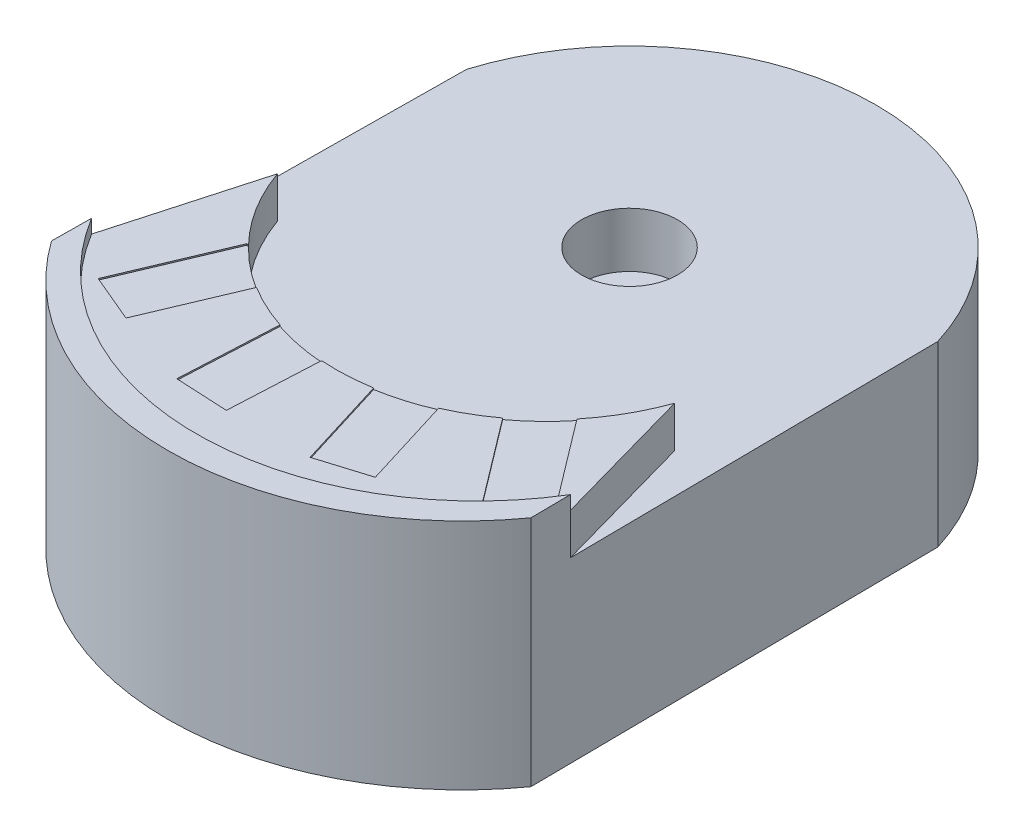
ISO-10303-21;
HEADER;
FILE_DESCRIPTION(('STEP AP214'),'2;1');
FILE_NAME('part.step','',(''),(''),'','','');
FILE_SCHEMA(('AUTOMOTIVE_DESIGN { 1 0 10303 214 1 1 1 1 }'));
ENDSEC;
DATA;
#1=APPLICATION_CONTEXT('core data for automotive mechanical design processes');
#2=APPLICATION_PROTOCOL_DEFINITION('international standard','automotive_design',2000,#1);
#3=PRODUCT_CONTEXT('',#1,'mechanical');
#4=PRODUCT('Part','Part','',(#3));
#5=PRODUCT_RELATED_PRODUCT_CATEGORY('part','',(#4));
#6=PRODUCT_DEFINITION_FORMATION('','',#4);
#7=PRODUCT_DEFINITION_CONTEXT('part definition',#1,'design');
#8=PRODUCT_DEFINITION('design','',#6,#7);
#9=PRODUCT_DEFINITION_SHAPE('','',#8);
#10=(LENGTH_UNIT() NAMED_UNIT(*) SI_UNIT(.MILLI.,.METRE.));
#11=(NAMED_UNIT(*) PLANE_ANGLE_UNIT() SI_UNIT($,.RADIAN.));
#12=(NAMED_UNIT(*) SI_UNIT($,.STERADIAN.) SOLID_ANGLE_UNIT());
#13=UNCERTAINTY_MEASURE_WITH_UNIT(LENGTH_MEASURE(1.E-05),#10,'distance_accuracy_value','');
#14=(GEOMETRIC_REPRESENTATION_CONTEXT(3) GLOBAL_UNCERTAINTY_ASSIGNED_CONTEXT((#13)) GLOBAL_UNIT_ASSIGNED_CONTEXT((#10,
#11,#12)) REPRESENTATION_CONTEXT('',''));
#15=CARTESIAN_POINT('',(0.,0.,0.));
#16=DIRECTION('',(0.,0.,1.));
#17=DIRECTION('',(1.,0.,0.));
#18=AXIS2_PLACEMENT_3D('',#15,#16,#17);
#19=CARTESIAN_POINT('',(0.,160.,-36.4056945380028));
#20=DIRECTION('',(0.,-1.,0.));
#21=DIRECTION('',(0.,0.,-1.));
#22=AXIS2_PLACEMENT_3D('',#19,#20,#21);
#23=CYLINDRICAL_SURFACE('',#22,153.872083252047);
#24=DIRECTION('',(0.,-1.,0.));
#25=VECTOR('',#24,1.);
#26=CARTESIAN_POINT('',(25.5188285225719,160.,115.335556923689));
#27=LINE('',#26,#25);
#28=CARTESIAN_POINT('',(25.5188285225719,159.,115.335556923689));
#29=VERTEX_POINT('',#28);
#30=CARTESIAN_POINT('',(25.5188285225719,160.,115.335556923689));
#31=VERTEX_POINT('',#30);
#32=EDGE_CURVE('E308',#29,#31,#27,.F.);
#33=ORIENTED_EDGE('',*,*,#32,.F.);
#34=CARTESIAN_POINT('',(0.,159.,-36.4056945380028));
#35=DIRECTION('',(0.,-1.,0.));
#36=DIRECTION('',(0.,0.,-1.));
#37=AXIS2_PLACEMENT_3D('',#34,#35,#36);
#38=CIRCLE('',#37,153.872083252047);
#39=CARTESIAN_POINT('',(62.0210257305321,159.,104.413375092703));
#40=VERTEX_POINT('',#39);
#41=EDGE_CURVE('E11',#29,#40,#38,.F.);
#42=ORIENTED_EDGE('',*,*,#41,.T.);
#43=DIRECTION('',(0.,-1.,0.));
#44=VECTOR('',#43,1.);
#45=CARTESIAN_POINT('',(62.0210257305321,160.,104.413375092703));
#46=LINE('',#45,#44);
#47=CARTESIAN_POINT('',(62.0210257305321,160.,104.413375092703));
#48=VERTEX_POINT('',#47);
#49=EDGE_CURVE('E241',#40,#48,#46,.F.);
#50=ORIENTED_EDGE('',*,*,#49,.T.);
#51=CARTESIAN_POINT('',(0.,160.,-36.4056945380028));
#52=DIRECTION('',(0.,-1.,0.));
#53=DIRECTION('',(0.,0.,1.));
#54=AXIS2_PLACEMENT_3D('',#51,#52,#53);
#55=CIRCLE('',#54,153.872083252047);
#56=CARTESIAN_POINT('',(91.6025285120061,160.,87.2292308452883));
#57=VERTEX_POINT('',#56);
#58=EDGE_CURVE('E348',#57,#48,#55,.T.);
#59=ORIENTED_EDGE('',*,*,#58,.F.);
#60=DIRECTION('',(0.,-1.,0.));
#61=VECTOR('',#60,1.);
#62=CARTESIAN_POINT('',(91.6025285120061,160.,87.2292308452883));
#63=LINE('',#62,#61);
#64=CARTESIAN_POINT('',(91.6025285120061,159.,87.2292308452883));
#65=VERTEX_POINT('',#64);
#66=EDGE_CURVE('E334',#65,#57,#63,.F.);
#67=ORIENTED_EDGE('',*,*,#66,.F.);
#68=CARTESIAN_POINT('',(0.,159.,-36.4056945380028));
#69=DIRECTION('',(0.,-1.,0.));
#70=DIRECTION('',(0.,0.,-1.));
#71=AXIS2_PLACEMENT_3D('',#68,#69,#70);
#72=CIRCLE('',#71,153.872083252047);
#73=CARTESIAN_POINT('',(119.332566816435,159.,60.7352160060414));
#74=VERTEX_POINT('',#73);
#75=EDGE_CURVE('E416',#65,#74,#72,.F.);
#76=ORIENTED_EDGE('',*,*,#75,.T.);
#77=DIRECTION('',(0.,-1.,0.));
#78=VECTOR('',#77,1.);
#79=CARTESIAN_POINT('',(119.332566816435,160.,60.7352160060414));
#80=LINE('',#79,#78);
#81=CARTESIAN_POINT('',(119.332566816435,160.,60.7352160060414));
#82=VERTEX_POINT('',#81);
#83=EDGE_CURVE('E331',#74,#82,#80,.F.);
#84=ORIENTED_EDGE('',*,*,#83,.T.);
#85=CARTESIAN_POINT('',(145.,160.,15.088169216088));
#86=VERTEX_POINT('',#85);
#87=EDGE_CURVE('E344',#86,#82,#55,.T.);
#88=ORIENTED_EDGE('',*,*,#87,.F.);
#89=DIRECTION('',(0.,-1.,0.));
#90=VECTOR('',#89,1.);
#91=CARTESIAN_POINT('',(145.,160.,15.088169216088));
#92=LINE('',#91,#90);
#93=CARTESIAN_POINT('',(145.,130.,15.088169216088));
#94=VERTEX_POINT('',#93);
#95=EDGE_CURVE('E361',#86,#94,#92,.T.);
#96=ORIENTED_EDGE('',*,*,#95,.T.);
#97=CARTESIAN_POINT('',(0.,130.,-36.4056945380028));
#98=DIRECTION('',(0.,-1.,0.));
#99=DIRECTION('',(0.,0.,1.));
#100=AXIS2_PLACEMENT_3D('',#97,#98,#99);
#101=CIRCLE('',#100,153.872083252047);
#102=CARTESIAN_POINT('',(-145.,130.,15.088169216088));
#103=VERTEX_POINT('',#102);
#104=EDGE_CURVE('E353',#94,#103,#101,.T.);
#105=ORIENTED_EDGE('',*,*,#104,.T.);
#106=DIRECTION('',(0.,-1.,0.));
#107=VECTOR('',#106,1.);
#108=CARTESIAN_POINT('',(-145.,160.,15.088169216088));
#109=LINE('',#108,#107);
#110=CARTESIAN_POINT('',(-145.,160.,15.088169216088));
#111=VERTEX_POINT('',#110);
#112=EDGE_CURVE('E358',#111,#103,#109,.T.);
#113=ORIENTED_EDGE('',*,*,#112,.F.);
#114=CARTESIAN_POINT('',(-110.21283358557,160.,70.970975727769));
#115=VERTEX_POINT('',#114);
#116=EDGE_CURVE('E343',#115,#111,#55,.T.);
#117=ORIENTED_EDGE('',*,*,#116,.F.);
#118=DIRECTION('',(0.,-1.,0.));
#119=VECTOR('',#118,1.);
#120=CARTESIAN_POINT('',(-110.21283358557,160.,70.9709757277689));
#121=LINE('',#120,#119);
#122=CARTESIAN_POINT('',(-110.21283358557,159.,70.9709757277689));
#123=VERTEX_POINT('',#122);
#124=EDGE_CURVE('E300',#123,#115,#121,.F.);
#125=ORIENTED_EDGE('',*,*,#124,.F.);
#126=CARTESIAN_POINT('',(0.,159.,-36.4056945380028));
#127=DIRECTION('',(0.,-1.,0.));
#128=DIRECTION('',(0.,0.,-1.));
#129=AXIS2_PLACEMENT_3D('',#126,#127,#128);
#130=CIRCLE('',#129,153.872083252047);
#131=CARTESIAN_POINT('',(-80.8026947126652,159.,94.5429310045996));
#132=VERTEX_POINT('',#131);
#133=EDGE_CURVE('E419',#123,#132,#130,.F.);
#134=ORIENTED_EDGE('',*,*,#133,.T.);
#135=DIRECTION('',(0.,-1.,0.));
#136=VECTOR('',#135,1.);
#137=CARTESIAN_POINT('',(-80.8026947126652,160.,94.5429310045996));
#138=LINE('',#137,#136);
#139=CARTESIAN_POINT('',(-80.8026947126652,160.,94.5429310045996));
#140=VERTEX_POINT('',#139);
#141=EDGE_CURVE('E228',#132,#140,#138,.F.);
#142=ORIENTED_EDGE('',*,*,#141,.T.);
#143=CARTESIAN_POINT('',(-48.5375336598497,160.,109.610488916243));
#144=VERTEX_POINT('',#143);
#145=EDGE_CURVE('E565',#144,#140,#55,.T.);
#146=ORIENTED_EDGE('',*,*,#145,.F.);
#147=DIRECTION('',(0.,-1.,0.));
#148=VECTOR('',#147,1.);
#149=CARTESIAN_POINT('',(-48.5375336598497,160.,109.610488916243));
#150=LINE('',#149,#148);
#151=CARTESIAN_POINT('',(-48.5375336598497,159.,109.610488916243));
#152=VERTEX_POINT('',#151);
#153=EDGE_CURVE('E305',#152,#144,#150,.F.);
#154=ORIENTED_EDGE('',*,*,#153,.F.);
#155=CARTESIAN_POINT('',(0.,159.,-36.4056945380028));
#156=DIRECTION('',(0.,-1.,0.));
#157=DIRECTION('',(0.,0.,-1.));
#158=AXIS2_PLACEMENT_3D('',#155,#156,#157);
#159=CIRCLE('',#158,153.872083252047);
#160=CARTESIAN_POINT('',(-10.765556062827,159.,117.08932429643));
#161=VERTEX_POINT('',#160);
#162=EDGE_CURVE('E53',#152,#161,#159,.F.);
#163=ORIENTED_EDGE('',*,*,#162,.T.);
#164=DIRECTION('',(0.,-1.,0.));
#165=VECTOR('',#164,1.);
#166=CARTESIAN_POINT('',(-10.765556062827,160.,117.08932429643));
#167=LINE('',#166,#165);
#168=CARTESIAN_POINT('',(-10.765556062827,160.,117.08932429643));
#169=VERTEX_POINT('',#168);
#170=EDGE_CURVE('E302',#161,#169,#167,.F.);
#171=ORIENTED_EDGE('',*,*,#170,.T.);
#172=EDGE_CURVE('E441',#31,#169,#55,.T.);
#173=ORIENTED_EDGE('',*,*,#172,.F.);
#174=EDGE_LOOP('',(#33,#42,#50,#59,#67,#76,#84,#88,#96,#105,#113,#117,#125,#134,#142,#146,#154,
#163,#171,#173));
#175=FACE_BOUND('',#174,.T.);
#176=ADVANCED_FACE('F45',(#175),#23,.F.);
#177=CARTESIAN_POINT('',(0.,160.,14.3906054712742));
#178=DIRECTION('',(0.,1.,0.));
#179=DIRECTION('',(0.,0.,1.));
#180=AXIS2_PLACEMENT_3D('',#177,#178,#179);
#181=PLANE('',#180);
#182=DIRECTION('',(-0.955688260041847,0.,0.294380620316941));
#183=VECTOR('',#182,1.);
#184=CARTESIAN_POINT('',(82.5870614919651,160.,171.179723066429));
#185=LINE('',#184,#183);
#186=CARTESIAN_POINT('',(82.5870614919651,160.,171.179723066429));
#187=VERTEX_POINT('',#186);
#188=CARTESIAN_POINT('',(46.1753387843707,160.,182.395624700504));
#189=VERTEX_POINT('',#188);
#190=EDGE_CURVE('E224',#187,#189,#185,.T.);
#191=ORIENTED_EDGE('',*,*,#190,.T.);
#192=DIRECTION('',(-0.294380620316942,0.,-0.955688260041846));
#193=VECTOR('',#192,1.);
#194=CARTESIAN_POINT('',(46.1753387843707,160.,182.395624700504));
#195=LINE('',#194,#193);
#196=EDGE_CURVE('E60',#189,#31,#195,.T.);
#197=ORIENTED_EDGE('',*,*,#196,.T.);
#198=ORIENTED_EDGE('',*,*,#172,.T.);
#199=DIRECTION('',(0.0502373390599633,0.,-0.998737307686148));
#200=VECTOR('',#199,1.);
#201=CARTESIAN_POINT('',(-14.0938428816101,160.,183.256925502998));
#202=LINE('',#201,#200);
#203=CARTESIAN_POINT('',(-14.0938428816101,160.,183.256925502998));
#204=VERTEX_POINT('',#203);
#205=EDGE_CURVE('E262',#204,#169,#202,.T.);
#206=ORIENTED_EDGE('',*,*,#205,.F.);
#207=DIRECTION('',(-0.998737307686147,0.,-0.0502373390599649));
#208=VECTOR('',#207,1.);
#209=CARTESIAN_POINT('',(-14.0938428816101,160.,183.256925502998));
#210=LINE('',#209,#208);
#211=CARTESIAN_POINT('',(-52.1457343044524,160.,181.342882884813));
#212=VERTEX_POINT('',#211);
#213=EDGE_CURVE('E255',#204,#212,#210,.T.);
#214=ORIENTED_EDGE('',*,*,#213,.T.);
#215=DIRECTION('',(0.050237339059963,0.,-0.998737307686148));
#216=VECTOR('',#215,1.);
#217=CARTESIAN_POINT('',(-52.1457343044524,160.,181.342882884813));
#218=LINE('',#217,#216);
#219=EDGE_CURVE('E68',#212,#144,#218,.T.);
#220=ORIENTED_EDGE('',*,*,#219,.T.);
#221=ORIENTED_EDGE('',*,*,#145,.T.);
#222=DIRECTION('',(0.388795933922077,0.,-0.921323896230669));
#223=VECTOR('',#222,1.);
#224=CARTESIAN_POINT('',(-109.074821800695,160.,161.538966741674));
#225=LINE('',#224,#223);
#226=CARTESIAN_POINT('',(-109.074821800695,160.,161.538966741674));
#227=VERTEX_POINT('',#226);
#228=EDGE_CURVE('E288',#227,#140,#225,.T.);
#229=ORIENTED_EDGE('',*,*,#228,.F.);
#230=DIRECTION('',(-0.921323896230668,0.,-0.388795933922078));
#231=VECTOR('',#230,1.);
#232=CARTESIAN_POINT('',(-109.074821800695,160.,161.538966741674));
#233=LINE('',#232,#231);
#234=CARTESIAN_POINT('',(-144.177262247084,160.,146.725841659242));
#235=VERTEX_POINT('',#234);
#236=EDGE_CURVE('E273',#227,#235,#233,.T.);
#237=ORIENTED_EDGE('',*,*,#236,.T.);
#238=DIRECTION('',(0.388795933922076,0.,-0.921323896230669));
#239=VECTOR('',#238,1.);
#240=CARTESIAN_POINT('',(-144.177262247084,160.,146.725841659242));
#241=LINE('',#240,#239);
#242=CARTESIAN_POINT('',(-111.907199731551,160.,70.2559582720969));
#243=VERTEX_POINT('',#242);
#244=EDGE_CURVE('E282',#235,#243,#241,.T.);
#245=ORIENTED_EDGE('',*,*,#244,.T.);
#246=DIRECTION('',(0.921323896230669,0.,0.388795933922076));
#247=VECTOR('',#246,1.);
#248=CARTESIAN_POINT('',(-111.907199731551,160.,70.2559582720969));
#249=LINE('',#248,#247);
#250=EDGE_CURVE('E285',#243,#115,#249,.T.);
#251=ORIENTED_EDGE('',*,*,#250,.T.);
#252=ORIENTED_EDGE('',*,*,#116,.T.);
#253=DIRECTION('',(-0.270090909090909,0.,0.962834825308291));
#254=VECTOR('',#253,1.);
#255=CARTESIAN_POINT('',(-174.71,160.,121.));
#256=LINE('',#255,#254);
#257=CARTESIAN_POINT('',(-174.71,160.,121.));
#258=VERTEX_POINT('',#257);
#259=EDGE_CURVE('E347',#111,#258,#256,.T.);
#260=ORIENTED_EDGE('',*,*,#259,.T.);
#261=CARTESIAN_POINT('',(0.,160.,14.3906054712742));
#262=DIRECTION('',(0.,1.,0.));
#263=DIRECTION('',(0.,0.,1.));
#264=AXIS2_PLACEMENT_3D('',#261,#262,#263);
#265=CIRCLE('',#264,204.668383249054);
#266=CARTESIAN_POINT('',(174.71,160.,121.));
#267=VERTEX_POINT('',#266);
#268=EDGE_CURVE('E337',#258,#267,#265,.T.);
#269=ORIENTED_EDGE('',*,*,#268,.T.);
#270=DIRECTION('',(-0.27009090909091,0.,-0.96283482530829));
#271=VECTOR('',#270,1.);
#272=CARTESIAN_POINT('',(174.71,160.,121.));
#273=LINE('',#272,#271);
#274=EDGE_CURVE('E340',#267,#86,#273,.T.);
#275=ORIENTED_EDGE('',*,*,#274,.T.);
#276=ORIENTED_EDGE('',*,*,#87,.T.);
#277=DIRECTION('',(-0.603491932288381,0.,-0.797369103779947));
#278=VECTOR('',#277,1.);
#279=CARTESIAN_POINT('',(169.306747394393,160.,126.764048286342));
#280=LINE('',#279,#278);
#281=CARTESIAN_POINT('',(169.306747394393,160.,126.764048286342));
#282=VERTEX_POINT('',#281);
#283=EDGE_CURVE('E323',#282,#82,#280,.T.);
#284=ORIENTED_EDGE('',*,*,#283,.F.);
#285=DIRECTION('',(-0.797369103779948,0.,0.603491932288379));
#286=VECTOR('',#285,1.);
#287=CARTESIAN_POINT('',(169.306747394393,160.,126.764048286342));
#288=LINE('',#287,#286);
#289=CARTESIAN_POINT('',(138.926984540377,160.,149.757090906529));
#290=VERTEX_POINT('',#289);
#291=EDGE_CURVE('E315',#282,#290,#288,.T.);
#292=ORIENTED_EDGE('',*,*,#291,.T.);
#293=DIRECTION('',(-0.603491932288381,0.,-0.797369103779947));
#294=VECTOR('',#293,1.);
#295=CARTESIAN_POINT('',(138.926984540377,160.,149.757090906529));
#296=LINE('',#295,#294);
#297=EDGE_CURVE('E310',#290,#57,#296,.T.);
#298=ORIENTED_EDGE('',*,*,#297,.T.);
#299=ORIENTED_EDGE('',*,*,#58,.T.);
#300=DIRECTION('',(-0.294380620316942,0.,-0.955688260041847));
#301=VECTOR('',#300,1.);
#302=CARTESIAN_POINT('',(82.5870614919651,160.,171.179723066429));
#303=LINE('',#302,#301);
#304=EDGE_CURVE('E246',#187,#48,#303,.T.);
#305=ORIENTED_EDGE('',*,*,#304,.F.);
#306=EDGE_LOOP('',(#191,#197,#198,#206,#214,#220,#221,#229,#237,#245,#251,#252,#260,#269,#275,
#276,#284,#292,#298,#299,#305));
#307=FACE_BOUND('',#306,.T.);
#308=ADVANCED_FACE('F439',(#307),#181,.T.);
#309=CARTESIAN_POINT('',(0.,130.,24.8611111111111));
#310=DIRECTION('',(0.,-1.,0.));
#311=DIRECTION('',(0.,0.,-1.));
#312=AXIS2_PLACEMENT_3D('',#309,#310,#311);
#313=PLANE('',#312);
#314=CARTESIAN_POINT('',(0.,130.,-96.9340033543138));
#315=DIRECTION('',(0.,1.,0.));
#316=DIRECTION('',(0.,0.,1.));
#317=AXIS2_PLACEMENT_3D('',#314,#315,#316);
#318=CIRCLE('',#317,35.);
#319=CARTESIAN_POINT('',(0.,130.,-61.9340033543138));
#320=VERTEX_POINT('',#319);
#321=EDGE_CURVE('E366',#320,#320,#318,.T.);
#322=ORIENTED_EDGE('',*,*,#321,.F.);
#323=EDGE_LOOP('',(#322));
#324=FACE_BOUND('',#323,.T.);
#325=DIRECTION('',(-0.27009090909091,0.,-0.96283482530829));
#326=VECTOR('',#325,1.);
#327=CARTESIAN_POINT('',(174.71,130.,121.));
#328=LINE('',#327,#326);
#329=CARTESIAN_POINT('',(174.71,130.,121.));
#330=VERTEX_POINT('',#329);
#331=EDGE_CURVE('E336',#330,#94,#328,.T.);
#332=ORIENTED_EDGE('',*,*,#331,.F.);
#333=DIRECTION('',(-0.00999950003749688,0.,-0.999950003749688));
#334=VECTOR('',#333,1.);
#335=CARTESIAN_POINT('',(175.,130.,150.));
#336=LINE('',#335,#334);
#337=CARTESIAN_POINT('',(172.,130.,-150.));
#338=VERTEX_POINT('',#337);
#339=EDGE_CURVE('E389',#330,#338,#336,.T.);
#340=ORIENTED_EDGE('',*,*,#339,.T.);
#341=CARTESIAN_POINT('',(0.,130.,-96.9340033543138));
#342=DIRECTION('',(0.,1.,0.));
#343=DIRECTION('',(0.,0.,-1.));
#344=AXIS2_PLACEMENT_3D('',#341,#342,#343);
#345=CIRCLE('',#344,180.);
#346=CARTESIAN_POINT('',(-172.,130.,-150.));
#347=VERTEX_POINT('',#346);
#348=EDGE_CURVE('E391',#338,#347,#345,.T.);
#349=ORIENTED_EDGE('',*,*,#348,.T.);
#350=DIRECTION('',(-0.00999950003749688,0.,0.999950003749688));
#351=VECTOR('',#350,1.);
#352=CARTESIAN_POINT('',(-172.,130.,-150.));
#353=LINE('',#352,#351);
#354=CARTESIAN_POINT('',(-174.71,130.,121.));
#355=VERTEX_POINT('',#354);
#356=EDGE_CURVE('E394',#347,#355,#353,.T.);
#357=ORIENTED_EDGE('',*,*,#356,.T.);
#358=DIRECTION('',(-0.270090909090909,0.,0.962834825308291));
#359=VECTOR('',#358,1.);
#360=CARTESIAN_POINT('',(-174.71,130.,121.));
#361=LINE('',#360,#359);
#362=EDGE_CURVE('E341',#103,#355,#361,.T.);
#363=ORIENTED_EDGE('',*,*,#362,.F.);
#364=ORIENTED_EDGE('',*,*,#104,.F.);
#365=EDGE_LOOP('',(#332,#340,#349,#357,#363,#364));
#366=FACE_BOUND('',#365,.T.);
#367=ADVANCED_FACE('F457',(#324,#366),#313,.F.);
#368=CARTESIAN_POINT('',(0.,130.,24.8611111111111));
#369=DIRECTION('',(0.,-1.,0.));
#370=DIRECTION('',(0.,0.,-1.));
#371=AXIS2_PLACEMENT_3D('',#368,#369,#370);
#372=CYLINDRICAL_SURFACE('',#371,215.138888888889);
#373=CARTESIAN_POINT('',(0.,0.,24.8611111111111));
#374=DIRECTION('',(0.,1.,0.));
#375=DIRECTION('',(0.,0.,-1.));
#376=AXIS2_PLACEMENT_3D('',#373,#374,#375);
#377=CIRCLE('',#376,215.138888888889);
#378=CARTESIAN_POINT('',(-175.,0.,150.));
#379=VERTEX_POINT('',#378);
#380=CARTESIAN_POINT('',(175.,0.,150.));
#381=VERTEX_POINT('',#380);
#382=EDGE_CURVE('E388',#379,#381,#377,.T.);
#383=ORIENTED_EDGE('',*,*,#382,.T.);
#384=DIRECTION('',(0.,-1.,0.));
#385=VECTOR('',#384,1.);
#386=CARTESIAN_POINT('',(175.,130.,150.));
#387=LINE('',#386,#385);
#388=CARTESIAN_POINT('',(175.,170.,150.));
#389=VERTEX_POINT('',#388);
#390=EDGE_CURVE('E413',#389,#381,#387,.T.);
#391=ORIENTED_EDGE('',*,*,#390,.F.);
#392=CARTESIAN_POINT('',(0.,170.,24.8611111111111));
#393=DIRECTION('',(0.,1.,0.));
#394=DIRECTION('',(0.,0.,1.));
#395=AXIS2_PLACEMENT_3D('',#392,#393,#394);
#396=CIRCLE('',#395,215.138888888889);
#397=CARTESIAN_POINT('',(-175.,170.,150.));
#398=VERTEX_POINT('',#397);
#399=EDGE_CURVE('E370',#398,#389,#396,.T.);
#400=ORIENTED_EDGE('',*,*,#399,.F.);
#401=DIRECTION('',(0.,-1.,0.));
#402=VECTOR('',#401,1.);
#403=CARTESIAN_POINT('',(-175.,130.,150.));
#404=LINE('',#403,#402);
#405=EDGE_CURVE('E397',#398,#379,#404,.T.);
#406=ORIENTED_EDGE('',*,*,#405,.T.);
#407=EDGE_LOOP('',(#383,#391,#400,#406));
#408=FACE_BOUND('',#407,.T.);
#409=ADVANCED_FACE('F47',(#408),#372,.T.);
#410=CARTESIAN_POINT('',(175.,130.,150.));
#411=DIRECTION('',(-0.999950003749688,0.,0.00999950003749688));
#412=DIRECTION('',(0.00999950003749688,0.,0.999950003749688));
#413=AXIS2_PLACEMENT_3D('',#410,#411,#412);
#414=PLANE('',#413);
#415=DIRECTION('',(-0.00999950003749688,0.,-0.999950003749688));
#416=VECTOR('',#415,1.);
#417=CARTESIAN_POINT('',(175.,0.,150.));
#418=LINE('',#417,#416);
#419=CARTESIAN_POINT('',(172.,0.,-150.));
#420=VERTEX_POINT('',#419);
#421=EDGE_CURVE('E400',#381,#420,#418,.T.);
#422=ORIENTED_EDGE('',*,*,#421,.T.);
#423=DIRECTION('',(0.,-1.,0.));
#424=VECTOR('',#423,1.);
#425=CARTESIAN_POINT('',(172.,130.,-150.));
#426=LINE('',#425,#424);
#427=EDGE_CURVE('E410',#338,#420,#426,.T.);
#428=ORIENTED_EDGE('',*,*,#427,.F.);
#429=ORIENTED_EDGE('',*,*,#339,.F.);
#430=DIRECTION('',(0.,-1.,0.));
#431=VECTOR('',#430,1.);
#432=CARTESIAN_POINT('',(174.71,160.,121.));
#433=LINE('',#432,#431);
#434=EDGE_CURVE('E364',#267,#330,#433,.T.);
#435=ORIENTED_EDGE('',*,*,#434,.F.);
#436=DIRECTION('',(0.,-1.,0.));
#437=VECTOR('',#436,1.);
#438=CARTESIAN_POINT('',(174.71,170.,121.));
#439=LINE('',#438,#437);
#440=CARTESIAN_POINT('',(174.71,170.,121.));
#441=VERTEX_POINT('',#440);
#442=EDGE_CURVE('E385',#441,#267,#439,.T.);
#443=ORIENTED_EDGE('',*,*,#442,.F.);
#444=DIRECTION('',(-0.00999950003749731,0.,-0.999950003749688));
#445=VECTOR('',#444,1.);
#446=CARTESIAN_POINT('',(175.,170.,150.));
#447=LINE('',#446,#445);
#448=EDGE_CURVE('E375',#389,#441,#447,.T.);
#449=ORIENTED_EDGE('',*,*,#448,.F.);
#450=ORIENTED_EDGE('',*,*,#390,.T.);
#451=EDGE_LOOP('',(#422,#428,#429,#435,#443,#449,#450));
#452=FACE_BOUND('',#451,.T.);
#453=ADVANCED_FACE('F495',(#452),#414,.F.);
#454=CARTESIAN_POINT('',(0.,130.,-96.9340033543138));
#455=DIRECTION('',(0.,-1.,0.));
#456=DIRECTION('',(0.,0.,-1.));
#457=AXIS2_PLACEMENT_3D('',#454,#455,#456);
#458=CYLINDRICAL_SURFACE('',#457,180.);
#459=CARTESIAN_POINT('',(0.,0.,-96.9340033543138));
#460=DIRECTION('',(0.,1.,0.));
#461=DIRECTION('',(0.,0.,-1.));
#462=AXIS2_PLACEMENT_3D('',#459,#460,#461);
#463=CIRCLE('',#462,180.);
#464=CARTESIAN_POINT('',(-172.,0.,-150.));
#465=VERTEX_POINT('',#464);
#466=EDGE_CURVE('E402',#420,#465,#463,.T.);
#467=ORIENTED_EDGE('',*,*,#466,.T.);
#468=DIRECTION('',(0.,-1.,0.));
#469=VECTOR('',#468,1.);
#470=CARTESIAN_POINT('',(-172.,130.,-150.));
#471=LINE('',#470,#469);
#472=EDGE_CURVE('E407',#347,#465,#471,.T.);
#473=ORIENTED_EDGE('',*,*,#472,.F.);
#474=ORIENTED_EDGE('',*,*,#348,.F.);
#475=ORIENTED_EDGE('',*,*,#427,.T.);
#476=EDGE_LOOP('',(#467,#473,#474,#475));
#477=FACE_BOUND('',#476,.T.);
#478=ADVANCED_FACE('F492',(#477),#458,.T.);
#479=CARTESIAN_POINT('',(-172.,130.,-150.));
#480=DIRECTION('',(0.999950003749688,0.,0.00999950003749688));
#481=DIRECTION('',(0.00999950003749688,0.,-0.999950003749688));
#482=AXIS2_PLACEMENT_3D('',#479,#480,#481);
#483=PLANE('',#482);
#484=DIRECTION('',(-0.00999950003749688,0.,0.999950003749688));
#485=VECTOR('',#484,1.);
#486=CARTESIAN_POINT('',(-172.,0.,-150.));
#487=LINE('',#486,#485);
#488=EDGE_CURVE('E392',#465,#379,#487,.T.);
#489=ORIENTED_EDGE('',*,*,#488,.T.);
#490=ORIENTED_EDGE('',*,*,#405,.F.);
#491=DIRECTION('',(-0.00999950003749635,0.,0.999950003749688));
#492=VECTOR('',#491,1.);
#493=CARTESIAN_POINT('',(-175.,170.,150.));
#494=LINE('',#493,#492);
#495=CARTESIAN_POINT('',(-174.71,170.,121.));
#496=VERTEX_POINT('',#495);
#497=EDGE_CURVE('E379',#496,#398,#494,.T.);
#498=ORIENTED_EDGE('',*,*,#497,.F.);
#499=DIRECTION('',(0.,-1.,0.));
#500=VECTOR('',#499,1.);
#501=CARTESIAN_POINT('',(-174.71,170.,121.));
#502=LINE('',#501,#500);
#503=EDGE_CURVE('E382',#496,#258,#502,.T.);
#504=ORIENTED_EDGE('',*,*,#503,.T.);
#505=DIRECTION('',(0.,-1.,0.));
#506=VECTOR('',#505,1.);
#507=CARTESIAN_POINT('',(-174.71,160.,121.));
#508=LINE('',#507,#506);
#509=EDGE_CURVE('E351',#258,#355,#508,.T.);
#510=ORIENTED_EDGE('',*,*,#509,.T.);
#511=ORIENTED_EDGE('',*,*,#356,.F.);
#512=ORIENTED_EDGE('',*,*,#472,.T.);
#513=EDGE_LOOP('',(#489,#490,#498,#504,#510,#511,#512));
#514=FACE_BOUND('',#513,.T.);
#515=ADVANCED_FACE('F488',(#514),#483,.F.);
#516=CARTESIAN_POINT('',(0.,0.,24.8611111111111));
#517=DIRECTION('',(0.,-1.,0.));
#518=DIRECTION('',(0.,0.,-1.));
#519=AXIS2_PLACEMENT_3D('',#516,#517,#518);
#520=PLANE('',#519);
#521=ORIENTED_EDGE('',*,*,#382,.F.);
#522=ORIENTED_EDGE('',*,*,#488,.F.);
#523=ORIENTED_EDGE('',*,*,#466,.F.);
#524=ORIENTED_EDGE('',*,*,#421,.F.);
#525=EDGE_LOOP('',(#521,#522,#523,#524));
#526=FACE_BOUND('',#525,.T.);
#527=ADVANCED_FACE('F481',(#526),#520,.T.);
#528=CARTESIAN_POINT('',(0.,170.,14.3906054712742));
#529=DIRECTION('',(0.,-1.,0.));
#530=DIRECTION('',(0.,0.,-1.));
#531=AXIS2_PLACEMENT_3D('',#528,#529,#530);
#532=CYLINDRICAL_SURFACE('',#531,204.668383249054);
#533=ORIENTED_EDGE('',*,*,#442,.T.);
#534=ORIENTED_EDGE('',*,*,#268,.F.);
#535=ORIENTED_EDGE('',*,*,#503,.F.);
#536=CARTESIAN_POINT('',(0.,170.,14.3906054712742));
#537=DIRECTION('',(0.,-1.,0.));
#538=DIRECTION('',(0.,0.,1.));
#539=AXIS2_PLACEMENT_3D('',#536,#537,#538);
#540=CIRCLE('',#539,204.668383249054);
#541=EDGE_CURVE('E377',#441,#496,#540,.T.);
#542=ORIENTED_EDGE('',*,*,#541,.F.);
#543=EDGE_LOOP('',(#533,#534,#535,#542));
#544=FACE_BOUND('',#543,.T.);
#545=ADVANCED_FACE('F477',(#544),#532,.F.);
#546=CARTESIAN_POINT('',(0.,170.,24.8611111111111));
#547=DIRECTION('',(0.,1.,0.));
#548=DIRECTION('',(0.,0.,1.));
#549=AXIS2_PLACEMENT_3D('',#546,#547,#548);
#550=PLANE('',#549);
#551=ORIENTED_EDGE('',*,*,#399,.T.);
#552=ORIENTED_EDGE('',*,*,#448,.T.);
#553=ORIENTED_EDGE('',*,*,#541,.T.);
#554=ORIENTED_EDGE('',*,*,#497,.T.);
#555=EDGE_LOOP('',(#551,#552,#553,#554));
#556=FACE_BOUND('',#555,.T.);
#557=ADVANCED_FACE('F473',(#556),#550,.T.);
#558=CARTESIAN_POINT('',(0.,90.,-96.9340033543138));
#559=DIRECTION('',(0.,1.,0.));
#560=DIRECTION('',(0.,0.,1.));
#561=AXIS2_PLACEMENT_3D('',#558,#559,#560);
#562=CYLINDRICAL_SURFACE('',#561,35.);
#563=CARTESIAN_POINT('',(0.,90.,-96.9340033543138));
#564=DIRECTION('',(0.,1.,0.));
#565=DIRECTION('',(0.,0.,1.));
#566=AXIS2_PLACEMENT_3D('',#563,#564,#565);
#567=CIRCLE('',#566,35.);
#568=CARTESIAN_POINT('',(0.,90.,-61.9340033543138));
#569=VERTEX_POINT('',#568);
#570=EDGE_CURVE('E367',#569,#569,#567,.T.);
#571=ORIENTED_EDGE('',*,*,#570,.F.);
#572=EDGE_LOOP('',(#571));
#573=FACE_BOUND('',#572,.T.);
#574=ORIENTED_EDGE('',*,*,#321,.T.);
#575=EDGE_LOOP('',(#574));
#576=FACE_BOUND('',#575,.T.);
#577=ADVANCED_FACE('F469',(#573,#576),#562,.F.);
#578=CARTESIAN_POINT('',(0.,90.,-96.9340033543138));
#579=DIRECTION('',(0.,1.,0.));
#580=DIRECTION('',(0.,0.,1.));
#581=AXIS2_PLACEMENT_3D('',#578,#579,#580);
#582=PLANE('',#581);
#583=ORIENTED_EDGE('',*,*,#570,.T.);
#584=EDGE_LOOP('',(#583));
#585=FACE_BOUND('',#584,.T.);
#586=ADVANCED_FACE('F465',(#585),#582,.T.);
#587=CARTESIAN_POINT('',(174.71,160.,121.));
#588=DIRECTION('',(-0.96283482530829,0.,0.27009090909091));
#589=DIRECTION('',(0.27009090909091,0.,0.96283482530829));
#590=AXIS2_PLACEMENT_3D('',#587,#588,#589);
#591=PLANE('',#590);
#592=ORIENTED_EDGE('',*,*,#331,.T.);
#593=ORIENTED_EDGE('',*,*,#95,.F.);
#594=ORIENTED_EDGE('',*,*,#274,.F.);
#595=ORIENTED_EDGE('',*,*,#434,.T.);
#596=EDGE_LOOP('',(#592,#593,#594,#595));
#597=FACE_BOUND('',#596,.T.);
#598=ADVANCED_FACE('F462',(#597),#591,.F.);
#599=CARTESIAN_POINT('',(-174.71,160.,121.));
#600=DIRECTION('',(0.962834825308291,0.,0.270090909090909));
#601=DIRECTION('',(0.270090909090909,0.,-0.962834825308291));
#602=AXIS2_PLACEMENT_3D('',#599,#600,#601);
#603=PLANE('',#602);
#604=ORIENTED_EDGE('',*,*,#362,.T.);
#605=ORIENTED_EDGE('',*,*,#509,.F.);
#606=ORIENTED_EDGE('',*,*,#259,.F.);
#607=ORIENTED_EDGE('',*,*,#112,.T.);
#608=EDGE_LOOP('',(#604,#605,#606,#607));
#609=FACE_BOUND('',#608,.T.);
#610=ADVANCED_FACE('F461',(#609),#603,.F.);
#611=CARTESIAN_POINT('',(0.,159.,0.));
#612=DIRECTION('',(0.,-1.,0.));
#613=DIRECTION('',(0.,0.,-1.));
#614=AXIS2_PLACEMENT_3D('',#611,#612,#613);
#615=PLANE('',#614);
#616=DIRECTION('',(-0.603491932288381,0.,-0.797369103779947));
#617=VECTOR('',#616,1.);
#618=CARTESIAN_POINT('',(138.926984540377,159.,149.757090906529));
#619=LINE('',#618,#617);
#620=CARTESIAN_POINT('',(138.926984540377,159.,149.757090906529));
#621=VERTEX_POINT('',#620);
#622=EDGE_CURVE('E311',#621,#65,#619,.T.);
#623=ORIENTED_EDGE('',*,*,#622,.F.);
#624=DIRECTION('',(-0.797369103779948,0.,0.603491932288379));
#625=VECTOR('',#624,1.);
#626=CARTESIAN_POINT('',(169.306747394393,159.,126.764048286342));
#627=LINE('',#626,#625);
#628=CARTESIAN_POINT('',(169.306747394393,159.,126.764048286342));
#629=VERTEX_POINT('',#628);
#630=EDGE_CURVE('E318',#629,#621,#627,.T.);
#631=ORIENTED_EDGE('',*,*,#630,.F.);
#632=DIRECTION('',(-0.603491932288381,0.,-0.797369103779947));
#633=VECTOR('',#632,1.);
#634=CARTESIAN_POINT('',(169.306747394393,159.,126.764048286342));
#635=LINE('',#634,#633);
#636=EDGE_CURVE('E314',#629,#74,#635,.T.);
#637=ORIENTED_EDGE('',*,*,#636,.T.);
#638=ORIENTED_EDGE('',*,*,#75,.F.);
#639=EDGE_LOOP('',(#623,#631,#637,#638));
#640=FACE_BOUND('',#639,.T.);
#641=ADVANCED_FACE('F530',(#640),#615,.F.);
#642=CARTESIAN_POINT('',(138.926984540377,159.,149.757090906529));
#643=DIRECTION('',(0.797369103779947,0.,-0.603491932288381));
#644=DIRECTION('',(-0.603491932288381,0.,-0.797369103779947));
#645=AXIS2_PLACEMENT_3D('',#642,#643,#644);
#646=PLANE('',#645);
#647=ORIENTED_EDGE('',*,*,#66,.T.);
#648=ORIENTED_EDGE('',*,*,#297,.F.);
#649=DIRECTION('',(0.,1.,0.));
#650=VECTOR('',#649,1.);
#651=CARTESIAN_POINT('',(138.926984540377,159.,149.757090906529));
#652=LINE('',#651,#650);
#653=EDGE_CURVE('E320',#621,#290,#652,.T.);
#654=ORIENTED_EDGE('',*,*,#653,.F.);
#655=ORIENTED_EDGE('',*,*,#622,.T.);
#656=EDGE_LOOP('',(#647,#648,#654,#655));
#657=FACE_BOUND('',#656,.T.);
#658=ADVANCED_FACE('F534',(#657),#646,.T.);
#659=CARTESIAN_POINT('',(169.306747394393,159.,126.764048286342));
#660=DIRECTION('',(0.797369103779947,0.,-0.603491932288381));
#661=DIRECTION('',(-0.603491932288381,0.,-0.797369103779947));
#662=AXIS2_PLACEMENT_3D('',#659,#660,#661);
#663=PLANE('',#662);
#664=ORIENTED_EDGE('',*,*,#636,.F.);
#665=DIRECTION('',(0.,1.,0.));
#666=VECTOR('',#665,1.);
#667=CARTESIAN_POINT('',(169.306747394393,159.,126.764048286342));
#668=LINE('',#667,#666);
#669=EDGE_CURVE('E329',#629,#282,#668,.T.);
#670=ORIENTED_EDGE('',*,*,#669,.T.);
#671=ORIENTED_EDGE('',*,*,#283,.T.);
#672=ORIENTED_EDGE('',*,*,#83,.F.);
#673=EDGE_LOOP('',(#664,#670,#671,#672));
#674=FACE_BOUND('',#673,.T.);
#675=ADVANCED_FACE('F540',(#674),#663,.F.);
#676=CARTESIAN_POINT('',(169.306747394393,159.,126.764048286342));
#677=DIRECTION('',(-0.603491932288379,0.,-0.797369103779948));
#678=DIRECTION('',(-0.797369103779948,0.,0.603491932288379));
#679=AXIS2_PLACEMENT_3D('',#676,#677,#678);
#680=PLANE('',#679);
#681=ORIENTED_EDGE('',*,*,#291,.F.);
#682=ORIENTED_EDGE('',*,*,#669,.F.);
#683=ORIENTED_EDGE('',*,*,#630,.T.);
#684=ORIENTED_EDGE('',*,*,#653,.T.);
#685=EDGE_LOOP('',(#681,#682,#683,#684));
#686=FACE_BOUND('',#685,.T.);
#687=ADVANCED_FACE('F548',(#686),#680,.T.);
#688=CARTESIAN_POINT('',(-83.9473093953619,159.,-48.4670016771571));
#689=DIRECTION('',(0.,-1.,0.));
#690=DIRECTION('',(0.86602540378444,0.,-0.499999999999998));
#691=AXIS2_PLACEMENT_3D('',#688,#689,#690);
#692=PLANE('',#691);
#693=DIRECTION('',(0.921323896230669,0.,0.388795933922076));
#694=VECTOR('',#693,1.);
#695=CARTESIAN_POINT('',(-111.907199731551,159.,70.2559582720969));
#696=LINE('',#695,#694);
#697=CARTESIAN_POINT('',(-111.907199731551,159.,70.2559582720969));
#698=VERTEX_POINT('',#697);
#699=EDGE_CURVE('E272',#698,#123,#696,.T.);
#700=ORIENTED_EDGE('',*,*,#699,.F.);
#701=DIRECTION('',(0.388795933922076,0.,-0.921323896230669));
#702=VECTOR('',#701,1.);
#703=CARTESIAN_POINT('',(-144.177262247084,159.,146.725841659242));
#704=LINE('',#703,#702);
#705=CARTESIAN_POINT('',(-144.177262247084,159.,146.725841659242));
#706=VERTEX_POINT('',#705);
#707=EDGE_CURVE('E269',#706,#698,#704,.T.);
#708=ORIENTED_EDGE('',*,*,#707,.F.);
#709=DIRECTION('',(-0.921323896230668,0.,-0.388795933922078));
#710=VECTOR('',#709,1.);
#711=CARTESIAN_POINT('',(-109.074821800695,159.,161.538966741674));
#712=LINE('',#711,#710);
#713=CARTESIAN_POINT('',(-109.074821800695,159.,161.538966741674));
#714=VERTEX_POINT('',#713);
#715=EDGE_CURVE('E279',#714,#706,#712,.T.);
#716=ORIENTED_EDGE('',*,*,#715,.F.);
#717=DIRECTION('',(0.388795933922077,0.,-0.921323896230669));
#718=VECTOR('',#717,1.);
#719=CARTESIAN_POINT('',(-109.074821800695,159.,161.538966741674));
#720=LINE('',#719,#718);
#721=EDGE_CURVE('E276',#714,#132,#720,.T.);
#722=ORIENTED_EDGE('',*,*,#721,.T.);
#723=ORIENTED_EDGE('',*,*,#133,.F.);
#724=EDGE_LOOP('',(#700,#708,#716,#722,#723));
#725=FACE_BOUND('',#724,.T.);
#726=ADVANCED_FACE('F551',(#725),#692,.F.);
#727=CARTESIAN_POINT('',(-111.907199731551,159.,70.2559582720969));
#728=DIRECTION('',(-0.388795933922076,0.,0.921323896230669));
#729=DIRECTION('',(0.921323896230669,0.,0.388795933922076));
#730=AXIS2_PLACEMENT_3D('',#727,#728,#729);
#731=PLANE('',#730);
#732=ORIENTED_EDGE('',*,*,#124,.T.);
#733=ORIENTED_EDGE('',*,*,#250,.F.);
#734=DIRECTION('',(0.,1.,0.));
#735=VECTOR('',#734,1.);
#736=CARTESIAN_POINT('',(-111.907199731551,159.,70.2559582720969));
#737=LINE('',#736,#735);
#738=EDGE_CURVE('E263',#698,#243,#737,.T.);
#739=ORIENTED_EDGE('',*,*,#738,.F.);
#740=ORIENTED_EDGE('',*,*,#699,.T.);
#741=EDGE_LOOP('',(#732,#733,#739,#740));
#742=FACE_BOUND('',#741,.T.);
#743=ADVANCED_FACE('F569',(#742),#731,.T.);
#744=CARTESIAN_POINT('',(-109.074821800695,159.,161.538966741674));
#745=DIRECTION('',(0.921323896230669,0.,0.388795933922077));
#746=DIRECTION('',(0.388795933922077,0.,-0.921323896230669));
#747=AXIS2_PLACEMENT_3D('',#744,#745,#746);
#748=PLANE('',#747);
#749=ORIENTED_EDGE('',*,*,#721,.F.);
#750=DIRECTION('',(0.,1.,0.));
#751=VECTOR('',#750,1.);
#752=CARTESIAN_POINT('',(-109.074821800695,159.,161.538966741674));
#753=LINE('',#752,#751);
#754=EDGE_CURVE('E294',#714,#227,#753,.T.);
#755=ORIENTED_EDGE('',*,*,#754,.T.);
#756=ORIENTED_EDGE('',*,*,#228,.T.);
#757=ORIENTED_EDGE('',*,*,#141,.F.);
#758=EDGE_LOOP('',(#749,#755,#756,#757));
#759=FACE_BOUND('',#758,.T.);
#760=ADVANCED_FACE('F581',(#759),#748,.F.);
#761=CARTESIAN_POINT('',(-144.177262247084,159.,146.725841659242));
#762=DIRECTION('',(0.921323896230669,0.,0.388795933922076));
#763=DIRECTION('',(0.388795933922076,0.,-0.921323896230669));
#764=AXIS2_PLACEMENT_3D('',#761,#762,#763);
#765=PLANE('',#764);
#766=ORIENTED_EDGE('',*,*,#244,.F.);
#767=DIRECTION('',(0.,1.,0.));
#768=VECTOR('',#767,1.);
#769=CARTESIAN_POINT('',(-144.177262247084,159.,146.725841659242));
#770=LINE('',#769,#768);
#771=EDGE_CURVE('E281',#706,#235,#770,.T.);
#772=ORIENTED_EDGE('',*,*,#771,.F.);
#773=ORIENTED_EDGE('',*,*,#707,.T.);
#774=ORIENTED_EDGE('',*,*,#738,.T.);
#775=EDGE_LOOP('',(#766,#772,#773,#774));
#776=FACE_BOUND('',#775,.T.);
#777=ADVANCED_FACE('F546',(#776),#765,.T.);
#778=CARTESIAN_POINT('',(-109.074821800695,159.,161.538966741674));
#779=DIRECTION('',(0.388795933922078,0.,-0.921323896230668));
#780=DIRECTION('',(-0.921323896230668,0.,-0.388795933922078));
#781=AXIS2_PLACEMENT_3D('',#778,#779,#780);
#782=PLANE('',#781);
#783=ORIENTED_EDGE('',*,*,#236,.F.);
#784=ORIENTED_EDGE('',*,*,#754,.F.);
#785=ORIENTED_EDGE('',*,*,#715,.T.);
#786=ORIENTED_EDGE('',*,*,#771,.T.);
#787=EDGE_LOOP('',(#783,#784,#785,#786));
#788=FACE_BOUND('',#787,.T.);
#789=ADVANCED_FACE('F578',(#788),#782,.T.);
#790=CARTESIAN_POINT('',(-62.3079763134665,159.,-22.6782487354654));
#791=DIRECTION('',(0.,-1.,0.));
#792=DIRECTION('',(0.642787609686541,0.,-0.766044443118977));
#793=AXIS2_PLACEMENT_3D('',#790,#791,#792);
#794=PLANE('',#793);
#795=DIRECTION('',(0.050237339059963,0.,-0.998737307686148));
#796=VECTOR('',#795,1.);
#797=CARTESIAN_POINT('',(-52.1457343044524,159.,181.342882884813));
#798=LINE('',#797,#796);
#799=CARTESIAN_POINT('',(-52.1457343044524,159.,181.342882884813));
#800=VERTEX_POINT('',#799);
#801=EDGE_CURVE('E251',#800,#152,#798,.T.);
#802=ORIENTED_EDGE('',*,*,#801,.F.);
#803=DIRECTION('',(-0.998737307686147,0.,-0.0502373390599649));
#804=VECTOR('',#803,1.);
#805=CARTESIAN_POINT('',(-14.0938428816101,159.,183.256925502998));
#806=LINE('',#805,#804);
#807=CARTESIAN_POINT('',(-14.0938428816101,159.,183.256925502998));
#808=VERTEX_POINT('',#807);
#809=EDGE_CURVE('E258',#808,#800,#806,.T.);
#810=ORIENTED_EDGE('',*,*,#809,.F.);
#811=DIRECTION('',(0.0502373390599633,0.,-0.998737307686148));
#812=VECTOR('',#811,1.);
#813=CARTESIAN_POINT('',(-14.0938428816101,159.,183.256925502998));
#814=LINE('',#813,#812);
#815=EDGE_CURVE('E254',#808,#161,#814,.T.);
#816=ORIENTED_EDGE('',*,*,#815,.T.);
#817=ORIENTED_EDGE('',*,*,#162,.F.);
#818=EDGE_LOOP('',(#802,#810,#816,#817));
#819=FACE_BOUND('',#818,.T.);
#820=ADVANCED_FACE('F430',(#819),#794,.F.);
#821=CARTESIAN_POINT('',(-52.1457343044524,159.,181.342882884813));
#822=DIRECTION('',(0.998737307686147,0.,0.050237339059963));
#823=DIRECTION('',(0.050237339059963,0.,-0.998737307686148));
#824=AXIS2_PLACEMENT_3D('',#821,#822,#823);
#825=PLANE('',#824);
#826=ORIENTED_EDGE('',*,*,#153,.T.);
#827=ORIENTED_EDGE('',*,*,#219,.F.);
#828=DIRECTION('',(0.,1.,0.));
#829=VECTOR('',#828,1.);
#830=CARTESIAN_POINT('',(-52.1457343044524,159.,181.342882884813));
#831=LINE('',#830,#829);
#832=EDGE_CURVE('E260',#800,#212,#831,.T.);
#833=ORIENTED_EDGE('',*,*,#832,.F.);
#834=ORIENTED_EDGE('',*,*,#801,.T.);
#835=EDGE_LOOP('',(#826,#827,#833,#834));
#836=FACE_BOUND('',#835,.T.);
#837=ADVANCED_FACE('F433',(#836),#825,.T.);
#838=CARTESIAN_POINT('',(-14.0938428816101,159.,183.256925502998));
#839=DIRECTION('',(0.998737307686147,0.,0.0502373390599633));
#840=DIRECTION('',(0.0502373390599633,0.,-0.998737307686148));
#841=AXIS2_PLACEMENT_3D('',#838,#839,#840);
#842=PLANE('',#841);
#843=ORIENTED_EDGE('',*,*,#815,.F.);
#844=DIRECTION('',(0.,1.,0.));
#845=VECTOR('',#844,1.);
#846=CARTESIAN_POINT('',(-14.0938428816101,159.,183.256925502998));
#847=LINE('',#846,#845);
#848=EDGE_CURVE('E247',#808,#204,#847,.T.);
#849=ORIENTED_EDGE('',*,*,#848,.T.);
#850=ORIENTED_EDGE('',*,*,#205,.T.);
#851=ORIENTED_EDGE('',*,*,#170,.F.);
#852=EDGE_LOOP('',(#843,#849,#850,#851));
#853=FACE_BOUND('',#852,.T.);
#854=ADVANCED_FACE('F443',(#853),#842,.F.);
#855=CARTESIAN_POINT('',(-14.0938428816101,159.,183.256925502998));
#856=DIRECTION('',(0.0502373390599649,0.,-0.998737307686147));
#857=DIRECTION('',(-0.998737307686148,0.,-0.0502373390599649));
#858=AXIS2_PLACEMENT_3D('',#855,#856,#857);
#859=PLANE('',#858);
#860=ORIENTED_EDGE('',*,*,#213,.F.);
#861=ORIENTED_EDGE('',*,*,#848,.F.);
#862=ORIENTED_EDGE('',*,*,#809,.T.);
#863=ORIENTED_EDGE('',*,*,#832,.T.);
#864=EDGE_LOOP('',(#860,#861,#862,#863));
#865=FACE_BOUND('',#864,.T.);
#866=ADVANCED_FACE('F436',(#865),#859,.T.);
#867=CARTESIAN_POINT('',(-33.1533817203733,159.,-5.84583569902866));
#868=DIRECTION('',(0.,-1.,0.));
#869=DIRECTION('',(0.342020143325669,0.,-0.939692620785908));
#870=AXIS2_PLACEMENT_3D('',#867,#868,#869);
#871=PLANE('',#870);
#872=DIRECTION('',(-0.294380620316942,0.,-0.955688260041846));
#873=VECTOR('',#872,1.);
#874=CARTESIAN_POINT('',(46.1753387843707,159.,182.395624700504));
#875=LINE('',#874,#873);
#876=CARTESIAN_POINT('',(46.1753387843707,159.,182.395624700504));
#877=VERTEX_POINT('',#876);
#878=EDGE_CURVE('E237',#877,#29,#875,.T.);
#879=ORIENTED_EDGE('',*,*,#878,.F.);
#880=DIRECTION('',(-0.955688260041847,0.,0.294380620316941));
#881=VECTOR('',#880,1.);
#882=CARTESIAN_POINT('',(82.5870614919651,159.,171.179723066429));
#883=LINE('',#882,#881);
#884=CARTESIAN_POINT('',(82.5870614919651,159.,171.179723066429));
#885=VERTEX_POINT('',#884);
#886=EDGE_CURVE('E222',#885,#877,#883,.T.);
#887=ORIENTED_EDGE('',*,*,#886,.F.);
#888=DIRECTION('',(-0.294380620316942,0.,-0.955688260041847));
#889=VECTOR('',#888,1.);
#890=CARTESIAN_POINT('',(82.5870614919651,159.,171.179723066429));
#891=LINE('',#890,#889);
#892=EDGE_CURVE('E235',#885,#40,#891,.T.);
#893=ORIENTED_EDGE('',*,*,#892,.T.);
#894=ORIENTED_EDGE('',*,*,#41,.F.);
#895=EDGE_LOOP('',(#879,#887,#893,#894));
#896=FACE_BOUND('',#895,.T.);
#897=ADVANCED_FACE('F234',(#896),#871,.F.);
#898=CARTESIAN_POINT('',(46.1753387843707,159.,182.395624700504));
#899=DIRECTION('',(0.955688260041847,0.,-0.294380620316942));
#900=DIRECTION('',(-0.294380620316942,0.,-0.955688260041847));
#901=AXIS2_PLACEMENT_3D('',#898,#899,#900);
#902=PLANE('',#901);
#903=ORIENTED_EDGE('',*,*,#32,.T.);
#904=ORIENTED_EDGE('',*,*,#196,.F.);
#905=DIRECTION('',(0.,1.,0.));
#906=VECTOR('',#905,1.);
#907=CARTESIAN_POINT('',(46.1753387843707,159.,182.395624700504));
#908=LINE('',#907,#906);
#909=EDGE_CURVE('E229',#877,#189,#908,.T.);
#910=ORIENTED_EDGE('',*,*,#909,.F.);
#911=ORIENTED_EDGE('',*,*,#878,.T.);
#912=EDGE_LOOP('',(#903,#904,#910,#911));
#913=FACE_BOUND('',#912,.T.);
#914=ADVANCED_FACE('F652',(#913),#902,.T.);
#915=CARTESIAN_POINT('',(82.5870614919651,159.,171.179723066429));
#916=DIRECTION('',(0.955688260041847,0.,-0.294380620316942));
#917=DIRECTION('',(-0.294380620316942,0.,-0.955688260041847));
#918=AXIS2_PLACEMENT_3D('',#915,#916,#917);
#919=PLANE('',#918);
#920=ORIENTED_EDGE('',*,*,#892,.F.);
#921=DIRECTION('',(0.,1.,0.));
#922=VECTOR('',#921,1.);
#923=CARTESIAN_POINT('',(82.5870614919651,159.,171.179723066429));
#924=LINE('',#923,#922);
#925=EDGE_CURVE('E219',#885,#187,#924,.T.);
#926=ORIENTED_EDGE('',*,*,#925,.T.);
#927=ORIENTED_EDGE('',*,*,#304,.T.);
#928=ORIENTED_EDGE('',*,*,#49,.F.);
#929=EDGE_LOOP('',(#920,#926,#927,#928));
#930=FACE_BOUND('',#929,.T.);
#931=ADVANCED_FACE('F239',(#930),#919,.F.);
#932=CARTESIAN_POINT('',(82.5870614919651,159.,171.179723066429));
#933=DIRECTION('',(-0.294380620316941,0.,-0.955688260041847));
#934=DIRECTION('',(-0.955688260041847,0.,0.294380620316941));
#935=AXIS2_PLACEMENT_3D('',#932,#933,#934);
#936=PLANE('',#935);
#937=ORIENTED_EDGE('',*,*,#190,.F.);
#938=ORIENTED_EDGE('',*,*,#925,.F.);
#939=ORIENTED_EDGE('',*,*,#886,.T.);
#940=ORIENTED_EDGE('',*,*,#909,.T.);
#941=EDGE_LOOP('',(#937,#938,#939,#940));
#942=FACE_BOUND('',#941,.T.);
#943=ADVANCED_FACE('F221',(#942),#936,.T.);
#944=CLOSED_SHELL('',(#176,#308,#367,#409,#453,#478,#515,#527,#545,#557,#577,#586,#598,#610,
#641,#658,#675,#687,#726,#743,#760,#777,#789,#820,#837,#854,#866,#897,#914,#931,#943));
#945=MANIFOLD_SOLID_BREP('B2',#944);
#946=ADVANCED_BREP_SHAPE_REPRESENTATION('',(#18,#945),#14);
#947=SHAPE_DEFINITION_REPRESENTATION(#9,#946);
ENDSEC;
END-ISO-10303-21;
